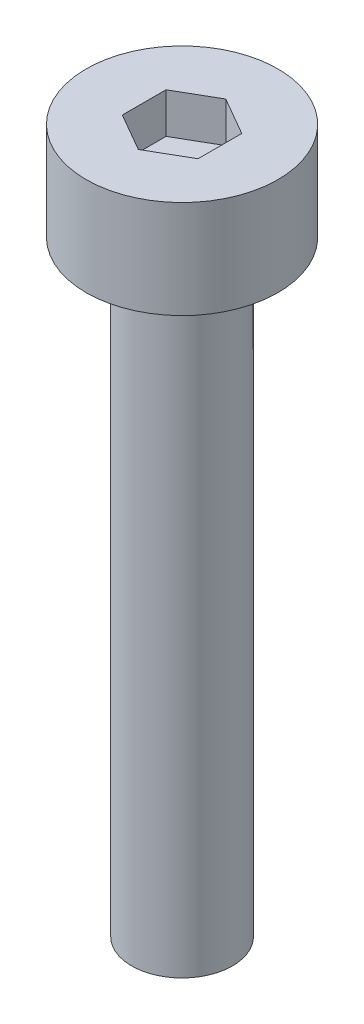
ISO-10303-21;
HEADER;
FILE_DESCRIPTION(('STEP AP214'),'2;1');
FILE_NAME('part.step','',(''),(''),'','','');
FILE_SCHEMA(('AUTOMOTIVE_DESIGN { 1 0 10303 214 1 1 1 1 }'));
ENDSEC;
DATA;
#1=APPLICATION_CONTEXT('core data for automotive mechanical design processes');
#2=APPLICATION_PROTOCOL_DEFINITION('international standard','automotive_design',2000,#1);
#3=PRODUCT_CONTEXT('',#1,'mechanical');
#4=PRODUCT('Part','Part','',(#3));
#5=PRODUCT_RELATED_PRODUCT_CATEGORY('part','',(#4));
#6=PRODUCT_DEFINITION_FORMATION('','',#4);
#7=PRODUCT_DEFINITION_CONTEXT('part definition',#1,'design');
#8=PRODUCT_DEFINITION('design','',#6,#7);
#9=PRODUCT_DEFINITION_SHAPE('','',#8);
#10=(LENGTH_UNIT() NAMED_UNIT(*) SI_UNIT(.MILLI.,.METRE.));
#11=(NAMED_UNIT(*) PLANE_ANGLE_UNIT() SI_UNIT($,.RADIAN.));
#12=(NAMED_UNIT(*) SI_UNIT($,.STERADIAN.) SOLID_ANGLE_UNIT());
#13=UNCERTAINTY_MEASURE_WITH_UNIT(LENGTH_MEASURE(1.E-05),#10,'distance_accuracy_value','');
#14=(GEOMETRIC_REPRESENTATION_CONTEXT(3) GLOBAL_UNCERTAINTY_ASSIGNED_CONTEXT((#13)) GLOBAL_UNIT_ASSIGNED_CONTEXT((#10,
#11,#12)) REPRESENTATION_CONTEXT('',''));
#15=CARTESIAN_POINT('',(0.,0.,0.));
#16=DIRECTION('',(0.,0.,1.));
#17=DIRECTION('',(1.,0.,0.));
#18=AXIS2_PLACEMENT_3D('',#15,#16,#17);
#19=CARTESIAN_POINT('',(0.,1.94,0.));
#20=DIRECTION('',(0.,-1.,0.));
#21=DIRECTION('',(0.,0.,-1.));
#22=AXIS2_PLACEMENT_3D('',#19,#20,#21);
#23=CYLINDRICAL_SURFACE('',#22,1.9);
#24=CARTESIAN_POINT('',(0.,1.94,0.));
#25=DIRECTION('',(0.,1.,0.));
#26=DIRECTION('',(0.,0.,1.));
#27=AXIS2_PLACEMENT_3D('',#24,#25,#26);
#28=CIRCLE('',#27,1.9);
#29=CARTESIAN_POINT('',(0.,1.94,1.9));
#30=VERTEX_POINT('',#29);
#31=EDGE_CURVE('E40',#30,#30,#28,.T.);
#32=ORIENTED_EDGE('',*,*,#31,.F.);
#33=EDGE_LOOP('',(#32));
#34=FACE_BOUND('',#33,.T.);
#35=CARTESIAN_POINT('',(0.,0.,0.));
#36=DIRECTION('',(0.,1.,0.));
#37=DIRECTION('',(0.,0.,1.));
#38=AXIS2_PLACEMENT_3D('',#35,#36,#37);
#39=CIRCLE('',#38,1.9);
#40=CARTESIAN_POINT('',(0.,0.,1.9));
#41=VERTEX_POINT('',#40);
#42=EDGE_CURVE('E35',#41,#41,#39,.T.);
#43=ORIENTED_EDGE('',*,*,#42,.T.);
#44=EDGE_LOOP('',(#43));
#45=FACE_BOUND('',#44,.T.);
#46=ADVANCED_FACE('F32',(#34,#45),#23,.T.);
#47=CARTESIAN_POINT('',(0.,1.94,0.));
#48=DIRECTION('',(0.,1.,0.));
#49=DIRECTION('',(0.,0.,1.));
#50=AXIS2_PLACEMENT_3D('',#47,#48,#49);
#51=PLANE('',#50);
#52=DIRECTION('',(-0.866025403784439,0.,-0.5));
#53=VECTOR('',#52,1.);
#54=CARTESIAN_POINT('',(0.75,1.94,-0.433012701892219));
#55=LINE('',#54,#53);
#56=CARTESIAN_POINT('',(0.75,1.94,-0.433012701892219));
#57=VERTEX_POINT('',#56);
#58=CARTESIAN_POINT('',(0.,1.94,-0.866025403784439));
#59=VERTEX_POINT('',#58);
#60=EDGE_CURVE('E48',#57,#59,#55,.T.);
#61=ORIENTED_EDGE('',*,*,#60,.F.);
#62=DIRECTION('',(0.,0.,-1.));
#63=VECTOR('',#62,1.);
#64=CARTESIAN_POINT('',(0.75,1.94,0.43301270189222));
#65=LINE('',#64,#63);
#66=CARTESIAN_POINT('',(0.75,1.94,0.43301270189222));
#67=VERTEX_POINT('',#66);
#68=EDGE_CURVE('E132',#67,#57,#65,.T.);
#69=ORIENTED_EDGE('',*,*,#68,.F.);
#70=DIRECTION('',(0.866025403784439,0.,-0.5));
#71=VECTOR('',#70,1.);
#72=CARTESIAN_POINT('',(0.,1.94,0.866025403784439));
#73=LINE('',#72,#71);
#74=CARTESIAN_POINT('',(0.,1.94,0.866025403784439));
#75=VERTEX_POINT('',#74);
#76=EDGE_CURVE('E130',#75,#67,#73,.T.);
#77=ORIENTED_EDGE('',*,*,#76,.F.);
#78=DIRECTION('',(0.866025403784438,0.,0.5));
#79=VECTOR('',#78,1.);
#80=CARTESIAN_POINT('',(-0.75,1.94,0.433012701892219));
#81=LINE('',#80,#79);
#82=CARTESIAN_POINT('',(-0.75,1.94,0.433012701892219));
#83=VERTEX_POINT('',#82);
#84=EDGE_CURVE('E96',#83,#75,#81,.T.);
#85=ORIENTED_EDGE('',*,*,#84,.F.);
#86=DIRECTION('',(0.,0.,1.));
#87=VECTOR('',#86,1.);
#88=CARTESIAN_POINT('',(-0.75,1.94,-0.43301270189222));
#89=LINE('',#88,#87);
#90=CARTESIAN_POINT('',(-0.75,1.94,-0.43301270189222));
#91=VERTEX_POINT('',#90);
#92=EDGE_CURVE('E126',#91,#83,#89,.T.);
#93=ORIENTED_EDGE('',*,*,#92,.F.);
#94=DIRECTION('',(-0.866025403784439,0.,0.5));
#95=VECTOR('',#94,1.);
#96=CARTESIAN_POINT('',(0.,1.94,-0.866025403784439));
#97=LINE('',#96,#95);
#98=EDGE_CURVE('E122',#59,#91,#97,.T.);
#99=ORIENTED_EDGE('',*,*,#98,.F.);
#100=EDGE_LOOP('',(#61,#69,#77,#85,#93,#99));
#101=FACE_BOUND('',#100,.T.);
#102=ORIENTED_EDGE('',*,*,#31,.T.);
#103=EDGE_LOOP('',(#102));
#104=FACE_BOUND('',#103,.T.);
#105=ADVANCED_FACE('F150',(#101,#104),#51,.T.);
#106=CARTESIAN_POINT('',(0.,0.,0.));
#107=DIRECTION('',(0.,1.,0.));
#108=DIRECTION('',(0.,0.,1.));
#109=AXIS2_PLACEMENT_3D('',#106,#107,#108);
#110=PLANE('',#109);
#111=CARTESIAN_POINT('',(0.,0.,0.));
#112=DIRECTION('',(0.,-1.,0.));
#113=DIRECTION('',(0.,0.,-1.));
#114=AXIS2_PLACEMENT_3D('',#111,#112,#113);
#115=CIRCLE('',#114,0.999999999999999);
#116=CARTESIAN_POINT('',(0.,0.,-0.999999999999999));
#117=VERTEX_POINT('',#116);
#118=EDGE_CURVE('E11',#117,#117,#115,.T.);
#119=ORIENTED_EDGE('',*,*,#118,.F.);
#120=EDGE_LOOP('',(#119));
#121=FACE_BOUND('',#120,.T.);
#122=ORIENTED_EDGE('',*,*,#42,.F.);
#123=EDGE_LOOP('',(#122));
#124=FACE_BOUND('',#123,.T.);
#125=ADVANCED_FACE('F147',(#121,#124),#110,.F.);
#126=CARTESIAN_POINT('',(0.75,1.14,-0.433012701892219));
#127=DIRECTION('',(0.5,0.,-0.866025403784439));
#128=DIRECTION('',(-0.866025403784439,0.,-0.5));
#129=AXIS2_PLACEMENT_3D('',#126,#127,#128);
#130=PLANE('',#129);
#131=ORIENTED_EDGE('',*,*,#60,.T.);
#132=DIRECTION('',(0.,1.,0.));
#133=VECTOR('',#132,1.);
#134=CARTESIAN_POINT('',(0.,1.14,-0.866025403784439));
#135=LINE('',#134,#133);
#136=CARTESIAN_POINT('',(0.,1.14,-0.866025403784439));
#137=VERTEX_POINT('',#136);
#138=EDGE_CURVE('E78',#137,#59,#135,.T.);
#139=ORIENTED_EDGE('',*,*,#138,.F.);
#140=DIRECTION('',(-0.866025403784439,0.,-0.5));
#141=VECTOR('',#140,1.);
#142=CARTESIAN_POINT('',(0.75,1.14,-0.433012701892219));
#143=LINE('',#142,#141);
#144=CARTESIAN_POINT('',(0.75,1.14,-0.433012701892219));
#145=VERTEX_POINT('',#144);
#146=EDGE_CURVE('E134',#145,#137,#143,.T.);
#147=ORIENTED_EDGE('',*,*,#146,.F.);
#148=DIRECTION('',(0.,1.,0.));
#149=VECTOR('',#148,1.);
#150=CARTESIAN_POINT('',(0.75,1.14,-0.433012701892219));
#151=LINE('',#150,#149);
#152=EDGE_CURVE('E56',#145,#57,#151,.T.);
#153=ORIENTED_EDGE('',*,*,#152,.T.);
#154=EDGE_LOOP('',(#131,#139,#147,#153));
#155=FACE_BOUND('',#154,.T.);
#156=ADVANCED_FACE('F149',(#155),#130,.F.);
#157=CARTESIAN_POINT('',(0.75,1.14,0.43301270189222));
#158=DIRECTION('',(1.,0.,0.));
#159=DIRECTION('',(0.,0.,-1.));
#160=AXIS2_PLACEMENT_3D('',#157,#158,#159);
#161=PLANE('',#160);
#162=ORIENTED_EDGE('',*,*,#68,.T.);
#163=ORIENTED_EDGE('',*,*,#152,.F.);
#164=DIRECTION('',(0.,0.,-1.));
#165=VECTOR('',#164,1.);
#166=CARTESIAN_POINT('',(0.75,1.14,0.43301270189222));
#167=LINE('',#166,#165);
#168=CARTESIAN_POINT('',(0.75,1.14,0.43301270189222));
#169=VERTEX_POINT('',#168);
#170=EDGE_CURVE('E108',#169,#145,#167,.T.);
#171=ORIENTED_EDGE('',*,*,#170,.F.);
#172=DIRECTION('',(0.,1.,0.));
#173=VECTOR('',#172,1.);
#174=CARTESIAN_POINT('',(0.75,1.14,0.43301270189222));
#175=LINE('',#174,#173);
#176=EDGE_CURVE('E100',#169,#67,#175,.T.);
#177=ORIENTED_EDGE('',*,*,#176,.T.);
#178=EDGE_LOOP('',(#162,#163,#171,#177));
#179=FACE_BOUND('',#178,.T.);
#180=ADVANCED_FACE('F156',(#179),#161,.F.);
#181=CARTESIAN_POINT('',(0.,1.14,0.866025403784439));
#182=DIRECTION('',(0.5,0.,0.866025403784439));
#183=DIRECTION('',(0.866025403784439,0.,-0.5));
#184=AXIS2_PLACEMENT_3D('',#181,#182,#183);
#185=PLANE('',#184);
#186=ORIENTED_EDGE('',*,*,#76,.T.);
#187=ORIENTED_EDGE('',*,*,#176,.F.);
#188=DIRECTION('',(0.866025403784439,0.,-0.5));
#189=VECTOR('',#188,1.);
#190=CARTESIAN_POINT('',(0.,1.14,0.866025403784439));
#191=LINE('',#190,#189);
#192=CARTESIAN_POINT('',(0.,1.14,0.866025403784439));
#193=VERTEX_POINT('',#192);
#194=EDGE_CURVE('E104',#193,#169,#191,.T.);
#195=ORIENTED_EDGE('',*,*,#194,.F.);
#196=DIRECTION('',(0.,1.,0.));
#197=VECTOR('',#196,1.);
#198=CARTESIAN_POINT('',(0.,1.14,0.866025403784439));
#199=LINE('',#198,#197);
#200=EDGE_CURVE('E89',#193,#75,#199,.T.);
#201=ORIENTED_EDGE('',*,*,#200,.T.);
#202=EDGE_LOOP('',(#186,#187,#195,#201));
#203=FACE_BOUND('',#202,.T.);
#204=ADVANCED_FACE('F105',(#203),#185,.F.);
#205=CARTESIAN_POINT('',(-0.75,1.14,0.433012701892219));
#206=DIRECTION('',(-0.5,0.,0.866025403784438));
#207=DIRECTION('',(0.866025403784439,0.,0.5));
#208=AXIS2_PLACEMENT_3D('',#205,#206,#207);
#209=PLANE('',#208);
#210=ORIENTED_EDGE('',*,*,#84,.T.);
#211=ORIENTED_EDGE('',*,*,#200,.F.);
#212=DIRECTION('',(0.866025403784438,0.,0.5));
#213=VECTOR('',#212,1.);
#214=CARTESIAN_POINT('',(-0.75,1.14,0.433012701892219));
#215=LINE('',#214,#213);
#216=CARTESIAN_POINT('',(-0.75,1.14,0.433012701892219));
#217=VERTEX_POINT('',#216);
#218=EDGE_CURVE('E93',#217,#193,#215,.T.);
#219=ORIENTED_EDGE('',*,*,#218,.F.);
#220=DIRECTION('',(0.,1.,0.));
#221=VECTOR('',#220,1.);
#222=CARTESIAN_POINT('',(-0.75,1.14,0.433012701892219));
#223=LINE('',#222,#221);
#224=EDGE_CURVE('E101',#217,#83,#223,.T.);
#225=ORIENTED_EDGE('',*,*,#224,.T.);
#226=EDGE_LOOP('',(#210,#211,#219,#225));
#227=FACE_BOUND('',#226,.T.);
#228=ADVANCED_FACE('F91',(#227),#209,.F.);
#229=CARTESIAN_POINT('',(-0.75,1.14,-0.43301270189222));
#230=DIRECTION('',(-1.,0.,0.));
#231=DIRECTION('',(0.,0.,1.));
#232=AXIS2_PLACEMENT_3D('',#229,#230,#231);
#233=PLANE('',#232);
#234=ORIENTED_EDGE('',*,*,#92,.T.);
#235=ORIENTED_EDGE('',*,*,#224,.F.);
#236=DIRECTION('',(0.,0.,1.));
#237=VECTOR('',#236,1.);
#238=CARTESIAN_POINT('',(-0.75,1.14,-0.43301270189222));
#239=LINE('',#238,#237);
#240=CARTESIAN_POINT('',(-0.75,1.14,-0.43301270189222));
#241=VERTEX_POINT('',#240);
#242=EDGE_CURVE('E114',#241,#217,#239,.T.);
#243=ORIENTED_EDGE('',*,*,#242,.F.);
#244=DIRECTION('',(0.,1.,0.));
#245=VECTOR('',#244,1.);
#246=CARTESIAN_POINT('',(-0.75,1.14,-0.43301270189222));
#247=LINE('',#246,#245);
#248=EDGE_CURVE('E138',#241,#91,#247,.T.);
#249=ORIENTED_EDGE('',*,*,#248,.T.);
#250=EDGE_LOOP('',(#234,#235,#243,#249));
#251=FACE_BOUND('',#250,.T.);
#252=ADVANCED_FACE('F201',(#251),#233,.F.);
#253=CARTESIAN_POINT('',(0.,1.14,-0.866025403784439));
#254=DIRECTION('',(-0.5,0.,-0.866025403784439));
#255=DIRECTION('',(-0.866025403784439,0.,0.5));
#256=AXIS2_PLACEMENT_3D('',#253,#254,#255);
#257=PLANE('',#256);
#258=ORIENTED_EDGE('',*,*,#98,.T.);
#259=ORIENTED_EDGE('',*,*,#248,.F.);
#260=DIRECTION('',(-0.866025403784439,0.,0.5));
#261=VECTOR('',#260,1.);
#262=CARTESIAN_POINT('',(0.,1.14,-0.866025403784439));
#263=LINE('',#262,#261);
#264=EDGE_CURVE('E116',#137,#241,#263,.T.);
#265=ORIENTED_EDGE('',*,*,#264,.F.);
#266=ORIENTED_EDGE('',*,*,#138,.T.);
#267=EDGE_LOOP('',(#258,#259,#265,#266));
#268=FACE_BOUND('',#267,.T.);
#269=ADVANCED_FACE('F210',(#268),#257,.F.);
#270=CARTESIAN_POINT('',(0.,1.14,0.));
#271=DIRECTION('',(0.,1.,0.));
#272=DIRECTION('',(0.,0.,1.));
#273=AXIS2_PLACEMENT_3D('',#270,#271,#272);
#274=PLANE('',#273);
#275=ORIENTED_EDGE('',*,*,#146,.T.);
#276=ORIENTED_EDGE('',*,*,#264,.T.);
#277=ORIENTED_EDGE('',*,*,#242,.T.);
#278=ORIENTED_EDGE('',*,*,#218,.T.);
#279=ORIENTED_EDGE('',*,*,#194,.T.);
#280=ORIENTED_EDGE('',*,*,#170,.T.);
#281=EDGE_LOOP('',(#275,#276,#277,#278,#279,#280));
#282=FACE_BOUND('',#281,.T.);
#283=ADVANCED_FACE('F111',(#282),#274,.T.);
#284=CARTESIAN_POINT('',(0.,-12.,0.));
#285=DIRECTION('',(0.,1.,0.));
#286=DIRECTION('',(0.,0.,1.));
#287=AXIS2_PLACEMENT_3D('',#284,#285,#286);
#288=CYLINDRICAL_SURFACE('',#287,0.999999999999999);
#289=CARTESIAN_POINT('',(0.,-12.,0.));
#290=DIRECTION('',(0.,-1.,0.));
#291=DIRECTION('',(0.,0.,-1.));
#292=AXIS2_PLACEMENT_3D('',#289,#290,#291);
#293=CIRCLE('',#292,0.999999999999999);
#294=CARTESIAN_POINT('',(0.,-12.,-0.999999999999999));
#295=VERTEX_POINT('',#294);
#296=EDGE_CURVE('E123',#295,#295,#293,.T.);
#297=ORIENTED_EDGE('',*,*,#296,.F.);
#298=EDGE_LOOP('',(#297));
#299=FACE_BOUND('',#298,.T.);
#300=ORIENTED_EDGE('',*,*,#118,.T.);
#301=EDGE_LOOP('',(#300));
#302=FACE_BOUND('',#301,.T.);
#303=ADVANCED_FACE('F228',(#299,#302),#288,.T.);
#304=CARTESIAN_POINT('',(0.,-12.,0.));
#305=DIRECTION('',(0.,-1.,0.));
#306=DIRECTION('',(0.,0.,-1.));
#307=AXIS2_PLACEMENT_3D('',#304,#305,#306);
#308=PLANE('',#307);
#309=ORIENTED_EDGE('',*,*,#296,.T.);
#310=EDGE_LOOP('',(#309));
#311=FACE_BOUND('',#310,.T.);
#312=ADVANCED_FACE('F241',(#311),#308,.T.);
#313=CLOSED_SHELL('',(#46,#105,#125,#156,#180,#204,#228,#252,#269,#283,#303,#312));
#314=MANIFOLD_SOLID_BREP('B2',#313);
#315=ADVANCED_BREP_SHAPE_REPRESENTATION('',(#18,#314),#14);
#316=SHAPE_DEFINITION_REPRESENTATION(#9,#315);
ENDSEC;
END-ISO-10303-21;
